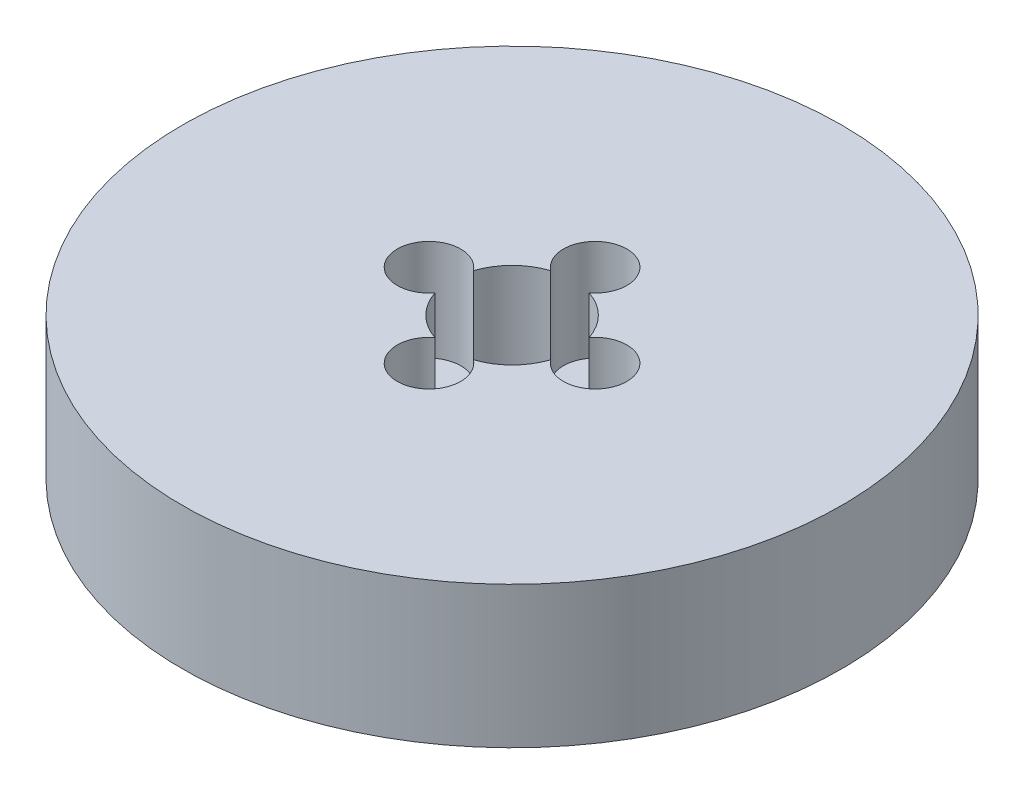
ISO-10303-21;
HEADER;
FILE_DESCRIPTION(('STEP AP214'),'2;1');
FILE_NAME('part.step','',(''),(''),'','','');
FILE_SCHEMA(('AUTOMOTIVE_DESIGN { 1 0 10303 214 1 1 1 1 }'));
ENDSEC;
DATA;
#1=APPLICATION_CONTEXT('core data for automotive mechanical design processes');
#2=APPLICATION_PROTOCOL_DEFINITION('international standard','automotive_design',2000,#1);
#3=PRODUCT_CONTEXT('',#1,'mechanical');
#4=PRODUCT('Part','Part','',(#3));
#5=PRODUCT_RELATED_PRODUCT_CATEGORY('part','',(#4));
#6=PRODUCT_DEFINITION_FORMATION('','',#4);
#7=PRODUCT_DEFINITION_CONTEXT('part definition',#1,'design');
#8=PRODUCT_DEFINITION('design','',#6,#7);
#9=PRODUCT_DEFINITION_SHAPE('','',#8);
#10=(LENGTH_UNIT() NAMED_UNIT(*) SI_UNIT(.MILLI.,.METRE.));
#11=(NAMED_UNIT(*) PLANE_ANGLE_UNIT() SI_UNIT($,.RADIAN.));
#12=(NAMED_UNIT(*) SI_UNIT($,.STERADIAN.) SOLID_ANGLE_UNIT());
#13=UNCERTAINTY_MEASURE_WITH_UNIT(LENGTH_MEASURE(1.E-05),#10,'distance_accuracy_value','');
#14=(GEOMETRIC_REPRESENTATION_CONTEXT(3) GLOBAL_UNCERTAINTY_ASSIGNED_CONTEXT((#13)) GLOBAL_UNIT_ASSIGNED_CONTEXT((#10,
#11,#12)) REPRESENTATION_CONTEXT('',''));
#15=CARTESIAN_POINT('',(0.,0.,0.));
#16=DIRECTION('',(0.,0.,1.));
#17=DIRECTION('',(1.,0.,0.));
#18=AXIS2_PLACEMENT_3D('',#15,#16,#17);
#19=CARTESIAN_POINT('',(0.,29.,0.));
#20=DIRECTION('',(0.,-1.,0.));
#21=DIRECTION('',(0.,0.,-1.));
#22=AXIS2_PLACEMENT_3D('',#19,#20,#21);
#23=CYLINDRICAL_SURFACE('',#22,67.5);
#24=CARTESIAN_POINT('',(0.,29.,0.));
#25=DIRECTION('',(0.,1.,0.));
#26=DIRECTION('',(0.,0.,1.));
#27=AXIS2_PLACEMENT_3D('',#24,#25,#26);
#28=CIRCLE('',#27,67.5);
#29=CARTESIAN_POINT('',(0.,29.,-67.5));
#30=VERTEX_POINT('',#29);
#31=EDGE_CURVE('E145',#30,#30,#28,.T.);
#32=CARTESIAN_POINT('',(0.,0.,0.));
#33=DIRECTION('',(0.,1.,0.));
#34=DIRECTION('',(0.,0.,1.));
#35=AXIS2_PLACEMENT_3D('',#32,#33,#34);
#36=CIRCLE('',#35,67.5);
#37=CARTESIAN_POINT('',(0.,0.,-67.5));
#38=VERTEX_POINT('',#37);
#39=EDGE_CURVE('E143',#38,#38,#36,.T.);
#40=CARTESIAN_POINT('',(0.,29.,-67.5));
#41=CARTESIAN_POINT('',(0.,28.6979166666667,-67.5));
#42=CARTESIAN_POINT('',(0.,28.3958333333333,-67.5));
#43=CARTESIAN_POINT('',(0.,27.7916666666667,-67.5));
#44=CARTESIAN_POINT('',(0.,27.4895833333333,-67.5));
#45=CARTESIAN_POINT('',(0.,26.8854166666667,-67.5));
#46=CARTESIAN_POINT('',(0.,26.5833333333333,-67.5));
#47=CARTESIAN_POINT('',(0.,25.9791666666667,-67.5));
#48=CARTESIAN_POINT('',(0.,25.6770833333333,-67.5));
#49=CARTESIAN_POINT('',(0.,25.0729166666667,-67.5));
#50=CARTESIAN_POINT('',(0.,24.7708333333333,-67.5));
#51=CARTESIAN_POINT('',(0.,24.1666666666667,-67.5));
#52=CARTESIAN_POINT('',(0.,23.8645833333333,-67.5));
#53=CARTESIAN_POINT('',(0.,23.2604166666667,-67.5));
#54=CARTESIAN_POINT('',(0.,22.9583333333333,-67.5));
#55=CARTESIAN_POINT('',(0.,22.3541666666667,-67.5));
#56=CARTESIAN_POINT('',(0.,22.0520833333333,-67.5));
#57=CARTESIAN_POINT('',(0.,21.4479166666667,-67.5));
#58=CARTESIAN_POINT('',(0.,21.1458333333333,-67.5));
#59=CARTESIAN_POINT('',(0.,20.5416666666667,-67.5));
#60=CARTESIAN_POINT('',(0.,20.2395833333333,-67.5));
#61=CARTESIAN_POINT('',(0.,19.6354166666667,-67.5));
#62=CARTESIAN_POINT('',(0.,19.3333333333333,-67.5));
#63=CARTESIAN_POINT('',(0.,18.7291666666667,-67.5));
#64=CARTESIAN_POINT('',(0.,18.4270833333333,-67.5));
#65=CARTESIAN_POINT('',(0.,17.8229166666667,-67.5));
#66=CARTESIAN_POINT('',(0.,17.5208333333333,-67.5));
#67=CARTESIAN_POINT('',(0.,16.9166666666667,-67.5));
#68=CARTESIAN_POINT('',(0.,16.6145833333333,-67.5));
#69=CARTESIAN_POINT('',(0.,16.0104166666667,-67.5));
#70=CARTESIAN_POINT('',(0.,15.7083333333333,-67.5));
#71=CARTESIAN_POINT('',(0.,15.1041666666667,-67.5));
#72=CARTESIAN_POINT('',(0.,14.8020833333333,-67.5));
#73=CARTESIAN_POINT('',(0.,14.1979166666667,-67.5));
#74=CARTESIAN_POINT('',(0.,13.8958333333333,-67.5));
#75=CARTESIAN_POINT('',(0.,13.2916666666667,-67.5));
#76=CARTESIAN_POINT('',(0.,12.9895833333333,-67.5));
#77=CARTESIAN_POINT('',(0.,12.3854166666667,-67.5));
#78=CARTESIAN_POINT('',(0.,12.0833333333333,-67.5));
#79=CARTESIAN_POINT('',(0.,11.4791666666667,-67.5));
#80=CARTESIAN_POINT('',(0.,11.1770833333333,-67.5));
#81=CARTESIAN_POINT('',(0.,10.5729166666667,-67.5));
#82=CARTESIAN_POINT('',(0.,10.2708333333333,-67.5));
#83=CARTESIAN_POINT('',(0.,9.66666666666667,-67.5));
#84=CARTESIAN_POINT('',(0.,9.36458333333333,-67.5));
#85=CARTESIAN_POINT('',(0.,8.76041666666667,-67.5));
#86=CARTESIAN_POINT('',(0.,8.45833333333333,-67.5));
#87=CARTESIAN_POINT('',(0.,7.85416666666667,-67.5));
#88=CARTESIAN_POINT('',(0.,7.55208333333333,-67.5));
#89=CARTESIAN_POINT('',(0.,6.94791666666667,-67.5));
#90=CARTESIAN_POINT('',(0.,6.64583333333333,-67.5));
#91=CARTESIAN_POINT('',(0.,6.04166666666667,-67.5));
#92=CARTESIAN_POINT('',(0.,5.73958333333333,-67.5));
#93=CARTESIAN_POINT('',(0.,5.13541666666667,-67.5));
#94=CARTESIAN_POINT('',(0.,4.83333333333333,-67.5));
#95=CARTESIAN_POINT('',(0.,4.22916666666667,-67.5));
#96=CARTESIAN_POINT('',(0.,3.92708333333333,-67.5));
#97=CARTESIAN_POINT('',(0.,3.32291666666667,-67.5));
#98=CARTESIAN_POINT('',(0.,3.02083333333333,-67.5));
#99=CARTESIAN_POINT('',(0.,2.41666666666667,-67.5));
#100=CARTESIAN_POINT('',(0.,2.11458333333333,-67.5));
#101=CARTESIAN_POINT('',(0.,1.51041666666667,-67.5));
#102=CARTESIAN_POINT('',(0.,1.20833333333333,-67.5));
#103=CARTESIAN_POINT('',(0.,0.604166666666667,-67.5));
#104=CARTESIAN_POINT('',(0.,0.302083333333333,-67.5));
#105=CARTESIAN_POINT('',(0.,0.,-67.5));
#106=B_SPLINE_CURVE_WITH_KNOTS('',3,(#40,#41,#42,#43,#44,#45,#46,#47,#48,#49,#50,#51,#52,#53,
#54,#55,#56,#57,#58,#59,#60,#61,#62,#63,#64,#65,#66,#67,#68,#69,#70,#71,#72,#73,#74,#75,#76,#77,
#78,#79,#80,#81,#82,#83,#84,#85,#86,#87,#88,#89,#90,#91,#92,#93,#94,#95,#96,#97,#98,#99,#100,
#101,#102,#103,#104,#105),.UNSPECIFIED.,.F.,.F.,(4,2,2,2,2,2,2,2,2,2,2,2,2,2,2,2,2,2,2,2,2,2,2,
2,2,2,2,2,2,2,2,2,4),(0.,0.906249999999997,1.8125,2.71875,3.625,4.53125,5.4375,6.34375,7.25,
8.15625,9.0625,9.96875,10.875,11.78125,12.6875,13.59375,14.5,15.40625,16.3125,17.21875,18.125,
19.03125,19.9375,20.84375,21.75,22.65625,23.5625,24.46875,25.375,26.28125,27.1875,28.09375,29.),.UNSPECIFIED.);
#107=EDGE_CURVE('BSEAM39',#30,#38,#106,.T.);
#108=ORIENTED_EDGE('',*,*,#31,.F.);
#109=ORIENTED_EDGE('',*,*,#39,.T.);
#110=ORIENTED_EDGE('',*,*,#107,.T.);
#111=ORIENTED_EDGE('',*,*,#107,.F.);
#112=EDGE_LOOP('',(#108,#110,#109,#111));
#113=FACE_BOUND('',#112,.T.);
#114=ADVANCED_FACE('F39',(#113),#23,.T.);
#115=CARTESIAN_POINT('',(0.,29.,0.));
#116=DIRECTION('',(0.,1.,0.));
#117=DIRECTION('',(0.,0.,1.));
#118=AXIS2_PLACEMENT_3D('',#115,#116,#117);
#119=PLANE('',#118);
#120=CARTESIAN_POINT('',(0.,29.,17.0175356591543));
#121=DIRECTION('',(0.,1.,0.));
#122=DIRECTION('',(1.,0.,0.));
#123=AXIS2_PLACEMENT_3D('',#120,#121,#122);
#124=CIRCLE('',#123,6.48890940859247);
#125=CARTESIAN_POINT('',(-3.94099145502279,29.,11.8624865163859));
#126=VERTEX_POINT('',#125);
#127=CARTESIAN_POINT('',(3.94099145502287,29.,11.8624865163859));
#128=VERTEX_POINT('',#127);
#129=EDGE_CURVE('E152',#126,#128,#124,.T.);
#130=ORIENTED_EDGE('',*,*,#129,.F.);
#131=CARTESIAN_POINT('',(0.,29.,0.));
#132=DIRECTION('',(0.,1.,0.));
#133=DIRECTION('',(0.,0.,1.));
#134=AXIS2_PLACEMENT_3D('',#131,#132,#133);
#135=CIRCLE('',#134,12.5);
#136=CARTESIAN_POINT('',(-11.8624865163859,29.,3.94099145502283));
#137=VERTEX_POINT('',#136);
#138=EDGE_CURVE('E133',#137,#126,#135,.T.);
#139=ORIENTED_EDGE('',*,*,#138,.F.);
#140=CARTESIAN_POINT('',(-17.0175356591543,29.,0.));
#141=DIRECTION('',(0.,1.,0.));
#142=DIRECTION('',(0.,0.,1.));
#143=AXIS2_PLACEMENT_3D('',#140,#141,#142);
#144=CIRCLE('',#143,6.48890940859247);
#145=CARTESIAN_POINT('',(-11.8624865163859,29.,-3.94099145502283));
#146=VERTEX_POINT('',#145);
#147=EDGE_CURVE('E128',#146,#137,#144,.T.);
#148=ORIENTED_EDGE('',*,*,#147,.F.);
#149=CARTESIAN_POINT('',(-3.94099145502296,29.,-11.8624865163858));
#150=VERTEX_POINT('',#149);
#151=EDGE_CURVE('E121',#150,#146,#135,.T.);
#152=ORIENTED_EDGE('',*,*,#151,.F.);
#153=CARTESIAN_POINT('',(-1.78249224561104E-13,29.,-17.0175356591543));
#154=DIRECTION('',(0.,1.,0.));
#155=DIRECTION('',(-1.,0.,0.));
#156=AXIS2_PLACEMENT_3D('',#153,#154,#155);
#157=CIRCLE('',#156,6.48890940859247);
#158=CARTESIAN_POINT('',(3.94099145502271,29.,-11.8624865163859));
#159=VERTEX_POINT('',#158);
#160=EDGE_CURVE('E105',#159,#150,#157,.T.);
#161=ORIENTED_EDGE('',*,*,#160,.F.);
#162=CARTESIAN_POINT('',(11.8624865163859,29.,-3.94099145502283));
#163=VERTEX_POINT('',#162);
#164=EDGE_CURVE('E131',#163,#159,#135,.T.);
#165=ORIENTED_EDGE('',*,*,#164,.F.);
#166=CARTESIAN_POINT('',(17.0175356591543,29.,0.));
#167=DIRECTION('',(0.,1.,0.));
#168=DIRECTION('',(0.,0.,-1.));
#169=AXIS2_PLACEMENT_3D('',#166,#167,#168);
#170=CIRCLE('',#169,6.48890940859247);
#171=CARTESIAN_POINT('',(11.8624865163859,29.,3.94099145502283));
#172=VERTEX_POINT('',#171);
#173=EDGE_CURVE('E154',#172,#163,#170,.T.);
#174=ORIENTED_EDGE('',*,*,#173,.F.);
#175=EDGE_CURVE('E134',#128,#172,#135,.T.);
#176=ORIENTED_EDGE('',*,*,#175,.F.);
#177=EDGE_LOOP('',(#130,#139,#148,#152,#161,#165,#174,#176));
#178=FACE_BOUND('',#177,.T.);
#179=ORIENTED_EDGE('',*,*,#31,.T.);
#180=EDGE_LOOP('',(#179));
#181=FACE_BOUND('',#180,.T.);
#182=ADVANCED_FACE('F130',(#178,#181),#119,.T.);
#183=CARTESIAN_POINT('',(0.,0.,0.));
#184=DIRECTION('',(0.,1.,0.));
#185=DIRECTION('',(0.,0.,1.));
#186=AXIS2_PLACEMENT_3D('',#183,#184,#185);
#187=PLANE('',#186);
#188=CARTESIAN_POINT('',(0.,0.,0.));
#189=DIRECTION('',(0.,1.,0.));
#190=DIRECTION('',(0.,0.,1.));
#191=AXIS2_PLACEMENT_3D('',#188,#189,#190);
#192=CIRCLE('',#191,12.5);
#193=CARTESIAN_POINT('',(0.,0.,12.5));
#194=VERTEX_POINT('',#193);
#195=EDGE_CURVE('E135',#194,#194,#192,.T.);
#196=ORIENTED_EDGE('',*,*,#195,.T.);
#197=EDGE_LOOP('',(#196));
#198=FACE_BOUND('',#197,.T.);
#199=ORIENTED_EDGE('',*,*,#39,.F.);
#200=EDGE_LOOP('',(#199));
#201=FACE_BOUND('',#200,.T.);
#202=ADVANCED_FACE('F195',(#198,#201),#187,.F.);
#203=CARTESIAN_POINT('',(0.,29.,0.));
#204=DIRECTION('',(0.,-1.,0.));
#205=DIRECTION('',(0.,0.,-1.));
#206=AXIS2_PLACEMENT_3D('',#203,#204,#205);
#207=CYLINDRICAL_SURFACE('',#206,12.5);
#208=DIRECTION('',(0.,1.,0.));
#209=VECTOR('',#208,1.);
#210=CARTESIAN_POINT('',(-3.94099145502279,18.6465138006529,11.8624865163859));
#211=LINE('',#210,#209);
#212=CARTESIAN_POINT('',(-3.94099145502279,8.29302760130571,11.8624865163859));
#213=VERTEX_POINT('',#212);
#214=EDGE_CURVE('E11',#213,#126,#211,.T.);
#215=ORIENTED_EDGE('',*,*,#214,.F.);
#216=CARTESIAN_POINT('',(0.,8.29302760130571,0.));
#217=DIRECTION('',(0.,1.,0.));
#218=DIRECTION('',(0.,0.,1.));
#219=AXIS2_PLACEMENT_3D('',#216,#217,#218);
#220=CIRCLE('',#219,12.5);
#221=CARTESIAN_POINT('',(3.94099145502287,8.29302760130571,11.8624865163859));
#222=VERTEX_POINT('',#221);
#223=EDGE_CURVE('E169',#213,#222,#220,.T.);
#224=ORIENTED_EDGE('',*,*,#223,.T.);
#225=DIRECTION('',(0.,1.,0.));
#226=VECTOR('',#225,1.);
#227=CARTESIAN_POINT('',(3.94099145502287,18.6465138006529,11.8624865163859));
#228=LINE('',#227,#226);
#229=EDGE_CURVE('E46',#128,#222,#228,.F.);
#230=ORIENTED_EDGE('',*,*,#229,.F.);
#231=ORIENTED_EDGE('',*,*,#175,.T.);
#232=DIRECTION('',(0.,1.,0.));
#233=VECTOR('',#232,1.);
#234=CARTESIAN_POINT('',(11.8624865163859,18.6465138006529,3.94099145502283));
#235=LINE('',#234,#233);
#236=CARTESIAN_POINT('',(11.8624865163859,8.29302760130571,3.94099145502283));
#237=VERTEX_POINT('',#236);
#238=EDGE_CURVE('E151',#237,#172,#235,.T.);
#239=ORIENTED_EDGE('',*,*,#238,.F.);
#240=CARTESIAN_POINT('',(0.,8.29302760130571,0.));
#241=DIRECTION('',(0.,1.,0.));
#242=DIRECTION('',(0.,0.,1.));
#243=AXIS2_PLACEMENT_3D('',#240,#241,#242);
#244=CIRCLE('',#243,12.5);
#245=CARTESIAN_POINT('',(11.8624865163859,8.29302760130571,-3.94099145502283));
#246=VERTEX_POINT('',#245);
#247=EDGE_CURVE('E173',#237,#246,#244,.T.);
#248=ORIENTED_EDGE('',*,*,#247,.T.);
#249=DIRECTION('',(0.,1.,0.));
#250=VECTOR('',#249,1.);
#251=CARTESIAN_POINT('',(11.8624865163859,18.6465138006529,-3.94099145502283));
#252=LINE('',#251,#250);
#253=EDGE_CURVE('E168',#163,#246,#252,.F.);
#254=ORIENTED_EDGE('',*,*,#253,.F.);
#255=ORIENTED_EDGE('',*,*,#164,.T.);
#256=DIRECTION('',(0.,1.,0.));
#257=VECTOR('',#256,1.);
#258=CARTESIAN_POINT('',(3.9409914550227,18.6465138006529,-11.8624865163859));
#259=LINE('',#258,#257);
#260=CARTESIAN_POINT('',(3.94099145502271,8.29302760130571,-11.8624865163859));
#261=VERTEX_POINT('',#260);
#262=EDGE_CURVE('E108',#261,#159,#259,.T.);
#263=ORIENTED_EDGE('',*,*,#262,.F.);
#264=CARTESIAN_POINT('',(0.,8.29302760130571,0.));
#265=DIRECTION('',(0.,1.,0.));
#266=DIRECTION('',(0.,0.,1.));
#267=AXIS2_PLACEMENT_3D('',#264,#265,#266);
#268=CIRCLE('',#267,12.5);
#269=CARTESIAN_POINT('',(-3.94099145502296,8.29302760130571,-11.8624865163858));
#270=VERTEX_POINT('',#269);
#271=EDGE_CURVE('E122',#261,#270,#268,.T.);
#272=ORIENTED_EDGE('',*,*,#271,.T.);
#273=DIRECTION('',(0.,1.,0.));
#274=VECTOR('',#273,1.);
#275=CARTESIAN_POINT('',(-3.94099145502295,18.6465138006529,-11.8624865163858));
#276=LINE('',#275,#274);
#277=EDGE_CURVE('E106',#150,#270,#276,.F.);
#278=ORIENTED_EDGE('',*,*,#277,.F.);
#279=ORIENTED_EDGE('',*,*,#151,.T.);
#280=DIRECTION('',(0.,1.,0.));
#281=VECTOR('',#280,1.);
#282=CARTESIAN_POINT('',(-11.8624865163859,18.6465138006529,-3.94099145502283));
#283=LINE('',#282,#281);
#284=CARTESIAN_POINT('',(-11.8624865163859,8.29302760130571,-3.94099145502283));
#285=VERTEX_POINT('',#284);
#286=EDGE_CURVE('E177',#285,#146,#283,.T.);
#287=ORIENTED_EDGE('',*,*,#286,.F.);
#288=CARTESIAN_POINT('',(0.,8.29302760130571,0.));
#289=DIRECTION('',(0.,1.,0.));
#290=DIRECTION('',(0.,0.,1.));
#291=AXIS2_PLACEMENT_3D('',#288,#289,#290);
#292=CIRCLE('',#291,12.5);
#293=CARTESIAN_POINT('',(-11.8624865163859,8.29302760130571,3.94099145502283));
#294=VERTEX_POINT('',#293);
#295=EDGE_CURVE('E185',#285,#294,#292,.T.);
#296=ORIENTED_EDGE('',*,*,#295,.T.);
#297=DIRECTION('',(0.,1.,0.));
#298=VECTOR('',#297,1.);
#299=CARTESIAN_POINT('',(-11.8624865163859,18.6465138006529,3.94099145502283));
#300=LINE('',#299,#298);
#301=EDGE_CURVE('E179',#137,#294,#300,.F.);
#302=ORIENTED_EDGE('',*,*,#301,.F.);
#303=ORIENTED_EDGE('',*,*,#138,.T.);
#304=EDGE_LOOP('',(#215,#224,#230,#231,#239,#248,#254,#255,#263,#272,#278,#279,#287,#296,#302,#303));
#305=FACE_BOUND('',#304,.T.);
#306=ORIENTED_EDGE('',*,*,#195,.F.);
#307=EDGE_LOOP('',(#306));
#308=FACE_BOUND('',#307,.T.);
#309=ADVANCED_FACE('F117',(#305,#308),#207,.F.);
#310=CARTESIAN_POINT('',(-17.0175356591543,8.29302760130571,0.));
#311=DIRECTION('',(0.,1.,0.));
#312=DIRECTION('',(0.,0.,1.));
#313=AXIS2_PLACEMENT_3D('',#310,#311,#312);
#314=CYLINDRICAL_SURFACE('',#313,6.48890940859247);
#315=ORIENTED_EDGE('',*,*,#286,.T.);
#316=ORIENTED_EDGE('',*,*,#147,.T.);
#317=ORIENTED_EDGE('',*,*,#301,.T.);
#318=CARTESIAN_POINT('',(-17.0175356591543,8.29302760130571,0.));
#319=DIRECTION('',(0.,1.,0.));
#320=DIRECTION('',(0.,0.,1.));
#321=AXIS2_PLACEMENT_3D('',#318,#319,#320);
#322=CIRCLE('',#321,6.48890940859247);
#323=EDGE_CURVE('E140',#285,#294,#322,.T.);
#324=ORIENTED_EDGE('',*,*,#323,.F.);
#325=EDGE_LOOP('',(#315,#316,#317,#324));
#326=FACE_BOUND('',#325,.T.);
#327=ADVANCED_FACE('F200',(#326),#314,.F.);
#328=CARTESIAN_POINT('',(-17.0175356591543,8.29302760130571,0.));
#329=DIRECTION('',(0.,1.,0.));
#330=DIRECTION('',(0.,0.,1.));
#331=AXIS2_PLACEMENT_3D('',#328,#329,#330);
#332=PLANE('',#331);
#333=ORIENTED_EDGE('',*,*,#323,.T.);
#334=ORIENTED_EDGE('',*,*,#295,.F.);
#335=EDGE_LOOP('',(#333,#334));
#336=FACE_BOUND('',#335,.T.);
#337=ADVANCED_FACE('F202',(#336),#332,.T.);
#338=CARTESIAN_POINT('',(-1.78249224561104E-13,8.29302760130571,-17.0175356591543));
#339=DIRECTION('',(0.,1.,0.));
#340=DIRECTION('',(0.,0.,1.));
#341=AXIS2_PLACEMENT_3D('',#338,#339,#340);
#342=CYLINDRICAL_SURFACE('',#341,6.48890940859247);
#343=ORIENTED_EDGE('',*,*,#262,.T.);
#344=ORIENTED_EDGE('',*,*,#160,.T.);
#345=ORIENTED_EDGE('',*,*,#277,.T.);
#346=CARTESIAN_POINT('',(-1.78249224561104E-13,8.29302760130571,-17.0175356591543));
#347=DIRECTION('',(0.,1.,0.));
#348=DIRECTION('',(-1.,0.,0.));
#349=AXIS2_PLACEMENT_3D('',#346,#347,#348);
#350=CIRCLE('',#349,6.48890940859247);
#351=EDGE_CURVE('E111',#261,#270,#350,.T.);
#352=ORIENTED_EDGE('',*,*,#351,.F.);
#353=EDGE_LOOP('',(#343,#344,#345,#352));
#354=FACE_BOUND('',#353,.T.);
#355=ADVANCED_FACE('F102',(#354),#342,.F.);
#356=CARTESIAN_POINT('',(-1.78249224561104E-13,8.29302760130571,-17.0175356591543));
#357=DIRECTION('',(0.,1.,0.));
#358=DIRECTION('',(-1.,0.,0.));
#359=AXIS2_PLACEMENT_3D('',#356,#357,#358);
#360=PLANE('',#359);
#361=ORIENTED_EDGE('',*,*,#351,.T.);
#362=ORIENTED_EDGE('',*,*,#271,.F.);
#363=EDGE_LOOP('',(#361,#362));
#364=FACE_BOUND('',#363,.T.);
#365=ADVANCED_FACE('F211',(#364),#360,.T.);
#366=CARTESIAN_POINT('',(17.0175356591543,8.29302760130571,0.));
#367=DIRECTION('',(0.,1.,0.));
#368=DIRECTION('',(0.,0.,1.));
#369=AXIS2_PLACEMENT_3D('',#366,#367,#368);
#370=CYLINDRICAL_SURFACE('',#369,6.48890940859247);
#371=ORIENTED_EDGE('',*,*,#238,.T.);
#372=ORIENTED_EDGE('',*,*,#173,.T.);
#373=ORIENTED_EDGE('',*,*,#253,.T.);
#374=CARTESIAN_POINT('',(17.0175356591543,8.29302760130571,0.));
#375=DIRECTION('',(0.,1.,0.));
#376=DIRECTION('',(0.,0.,-1.));
#377=AXIS2_PLACEMENT_3D('',#374,#375,#376);
#378=CIRCLE('',#377,6.48890940859247);
#379=EDGE_CURVE('E56',#237,#246,#378,.T.);
#380=ORIENTED_EDGE('',*,*,#379,.F.);
#381=EDGE_LOOP('',(#371,#372,#373,#380));
#382=FACE_BOUND('',#381,.T.);
#383=ADVANCED_FACE('F212',(#382),#370,.F.);
#384=CARTESIAN_POINT('',(17.0175356591543,8.29302760130571,0.));
#385=DIRECTION('',(0.,1.,0.));
#386=DIRECTION('',(0.,0.,-1.));
#387=AXIS2_PLACEMENT_3D('',#384,#385,#386);
#388=PLANE('',#387);
#389=ORIENTED_EDGE('',*,*,#379,.T.);
#390=ORIENTED_EDGE('',*,*,#247,.F.);
#391=EDGE_LOOP('',(#389,#390));
#392=FACE_BOUND('',#391,.T.);
#393=ADVANCED_FACE('F217',(#392),#388,.T.);
#394=CARTESIAN_POINT('',(0.,8.29302760130571,17.0175356591543));
#395=DIRECTION('',(0.,1.,0.));
#396=DIRECTION('',(0.,0.,1.));
#397=AXIS2_PLACEMENT_3D('',#394,#395,#396);
#398=CYLINDRICAL_SURFACE('',#397,6.48890940859247);
#399=ORIENTED_EDGE('',*,*,#214,.T.);
#400=ORIENTED_EDGE('',*,*,#129,.T.);
#401=ORIENTED_EDGE('',*,*,#229,.T.);
#402=CARTESIAN_POINT('',(0.,8.29302760130571,17.0175356591543));
#403=DIRECTION('',(0.,1.,0.));
#404=DIRECTION('',(1.,0.,0.));
#405=AXIS2_PLACEMENT_3D('',#402,#403,#404);
#406=CIRCLE('',#405,6.48890940859247);
#407=EDGE_CURVE('E55',#213,#222,#406,.T.);
#408=ORIENTED_EDGE('',*,*,#407,.F.);
#409=EDGE_LOOP('',(#399,#400,#401,#408));
#410=FACE_BOUND('',#409,.T.);
#411=ADVANCED_FACE('F170',(#410),#398,.F.);
#412=CARTESIAN_POINT('',(0.,8.29302760130571,17.0175356591543));
#413=DIRECTION('',(0.,1.,0.));
#414=DIRECTION('',(1.,0.,0.));
#415=AXIS2_PLACEMENT_3D('',#412,#413,#414);
#416=PLANE('',#415);
#417=ORIENTED_EDGE('',*,*,#407,.T.);
#418=ORIENTED_EDGE('',*,*,#223,.F.);
#419=EDGE_LOOP('',(#417,#418));
#420=FACE_BOUND('',#419,.T.);
#421=ADVANCED_FACE('F224',(#420),#416,.T.);
#422=CLOSED_SHELL('',(#114,#182,#202,#309,#327,#337,#355,#365,#383,#393,#411,#421));
#423=MANIFOLD_SOLID_BREP('B2',#422);
#424=ADVANCED_BREP_SHAPE_REPRESENTATION('',(#18,#423),#14);
#425=SHAPE_DEFINITION_REPRESENTATION(#9,#424);
ENDSEC;
END-ISO-10303-21;
